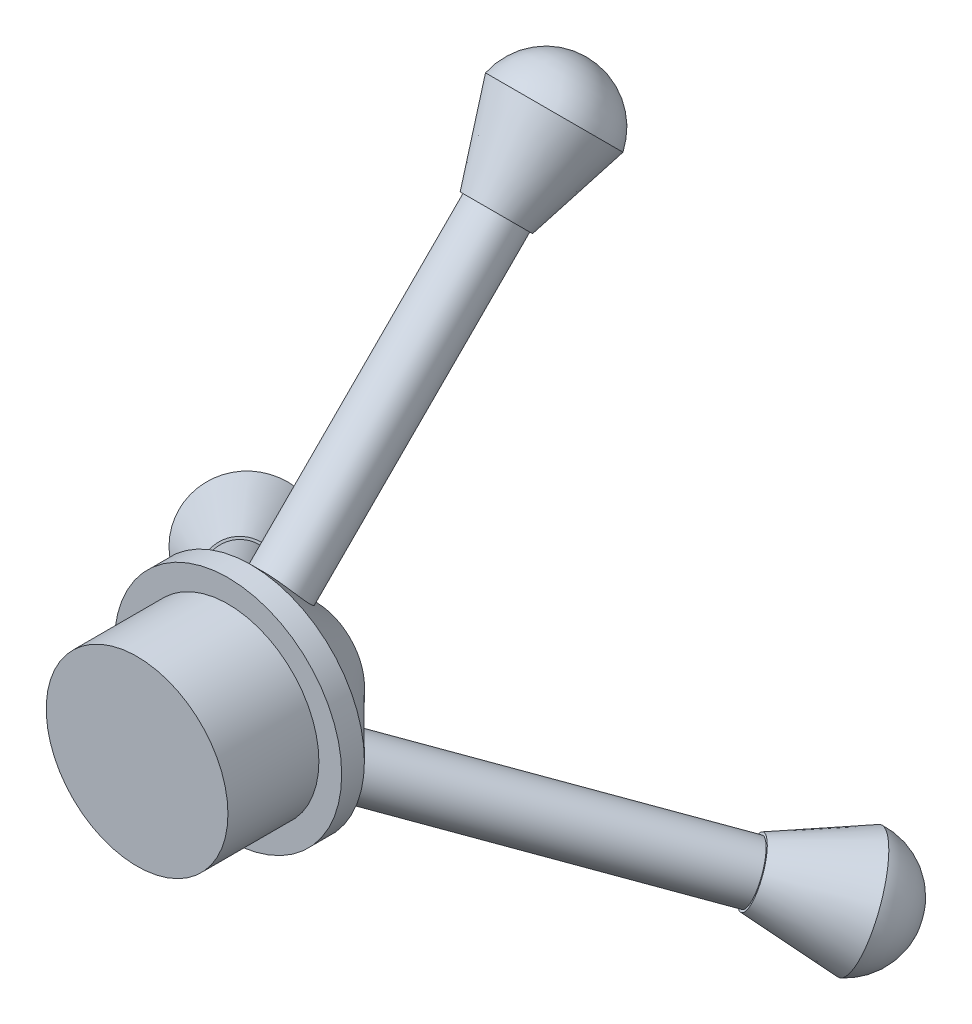
ISO-10303-21;
HEADER;
FILE_DESCRIPTION(('STEP AP214'),'2;1');
FILE_NAME('part.step','',(''),(''),'','','');
FILE_SCHEMA(('AUTOMOTIVE_DESIGN { 1 0 10303 214 1 1 1 1 }'));
ENDSEC;
DATA;
#1=APPLICATION_CONTEXT('core data for automotive mechanical design processes');
#2=APPLICATION_PROTOCOL_DEFINITION('international standard','automotive_design',2000,#1);
#3=PRODUCT_CONTEXT('',#1,'mechanical');
#4=PRODUCT('Part','Part','',(#3));
#5=PRODUCT_RELATED_PRODUCT_CATEGORY('part','',(#4));
#6=PRODUCT_DEFINITION_FORMATION('','',#4);
#7=PRODUCT_DEFINITION_CONTEXT('part definition',#1,'design');
#8=PRODUCT_DEFINITION('design','',#6,#7);
#9=PRODUCT_DEFINITION_SHAPE('','',#8);
#10=(LENGTH_UNIT() NAMED_UNIT(*) SI_UNIT(.MILLI.,.METRE.));
#11=(NAMED_UNIT(*) PLANE_ANGLE_UNIT() SI_UNIT($,.RADIAN.));
#12=(NAMED_UNIT(*) SI_UNIT($,.STERADIAN.) SOLID_ANGLE_UNIT());
#13=UNCERTAINTY_MEASURE_WITH_UNIT(LENGTH_MEASURE(1.E-05),#10,'distance_accuracy_value','');
#14=(GEOMETRIC_REPRESENTATION_CONTEXT(3) GLOBAL_UNCERTAINTY_ASSIGNED_CONTEXT((#13)) GLOBAL_UNIT_ASSIGNED_CONTEXT((#10,
#11,#12)) REPRESENTATION_CONTEXT('',''));
#15=CARTESIAN_POINT('',(0.,0.,0.));
#16=DIRECTION('',(0.,0.,1.));
#17=DIRECTION('',(1.,0.,0.));
#18=AXIS2_PLACEMENT_3D('',#15,#16,#17);
#19=CARTESIAN_POINT('',(0.,0.,20.));
#20=DIRECTION('',(0.,0.,1.));
#21=DIRECTION('',(1.,0.,0.));
#22=AXIS2_PLACEMENT_3D('',#19,#20,#21);
#23=CONICAL_SURFACE('',#22,25.,0.785398163397451);
#24=CARTESIAN_POINT('',(-10.9923285042417,-8.84226013293502,9.10733320665737));
#25=CARTESIAN_POINT('',(-11.042067666894,-8.69632022086392,9.05461272138038));
#26=CARTESIAN_POINT('',(-11.0959779072019,-8.5499775990663,9.00713308822177));
#27=CARTESIAN_POINT('',(-11.2115666896517,-8.25719647000872,8.923274107096));
#28=CARTESIAN_POINT('',(-11.2732426990432,-8.11075800942672,8.88689115320621));
#29=CARTESIAN_POINT('',(-11.403773007322,-7.81861217091363,8.82577518647563));
#30=CARTESIAN_POINT('',(-11.4726290599692,-7.67290498075085,8.8010450280647));
#31=CARTESIAN_POINT('',(-11.6168887808461,-7.38319204496107,8.76364056362473));
#32=CARTESIAN_POINT('',(-11.6922923353385,-7.23918626982796,8.75096604822173));
#33=CARTESIAN_POINT('',(-11.8490778468359,-6.95378965622903,8.73788033869601));
#34=CARTESIAN_POINT('',(-11.930463202042,-6.81240036214522,8.73747617006182));
#35=CARTESIAN_POINT('',(-12.0985801552729,-6.53334788850022,8.74895541058032));
#36=CARTESIAN_POINT('',(-12.1853117836209,-6.39568473007953,8.76083888943286));
#37=CARTESIAN_POINT('',(-12.3635500550898,-6.12513644507364,8.79669330174738));
#38=CARTESIAN_POINT('',(-12.4550560384702,-5.99225066259431,8.82066256908912));
#39=CARTESIAN_POINT('',(-12.6423797548508,-5.73219849195895,8.88031198722794));
#40=CARTESIAN_POINT('',(-12.7381991019757,-5.60503428109717,8.9159965540329));
#41=CARTESIAN_POINT('',(-12.933113083538,-5.35814442562773,8.9982929056253));
#42=CARTESIAN_POINT('',(-13.0321863504582,-5.23838108386113,9.04484232419296));
#43=CARTESIAN_POINT('',(-13.2337542669769,-5.0063836888108,9.14832780188348));
#44=CARTESIAN_POINT('',(-13.3362501430236,-4.89415237884872,9.20526761762284));
#45=CARTESIAN_POINT('',(-13.5442596997168,-4.67813130083381,9.32875460579492));
#46=CARTESIAN_POINT('',(-13.6497728980658,-4.57434019375656,9.39530024961165));
#47=CARTESIAN_POINT('',(-13.8635479336782,-4.37593398113424,9.53721141095034));
#48=CARTESIAN_POINT('',(-13.9718107982734,-4.28132237081603,9.6125802641223));
#49=CARTESIAN_POINT('',(-14.1950338456752,-4.0985367190131,9.77437524353499));
#50=CARTESIAN_POINT('',(-14.3100901184568,-4.01076106144288,9.86111924034591));
#51=CARTESIAN_POINT('',(-14.5424704478156,-3.84670488647274,10.0422254278622));
#52=CARTESIAN_POINT('',(-14.659795339825,-3.77042869841636,10.1365904673226));
#53=CARTESIAN_POINT('',(-14.8962366034766,-3.63013726739487,10.331875211531));
#54=CARTESIAN_POINT('',(-15.0153524220095,-3.56611831951722,10.4327929232576));
#55=CARTESIAN_POINT('',(-15.2549966714236,-3.45092697572059,10.6402333038166));
#56=CARTESIAN_POINT('',(-15.3755256020289,-3.3997592772234,10.7467580049714));
#57=CARTESIAN_POINT('',(-15.6192013830514,-3.31019935829013,10.9659625442163));
#58=CARTESIAN_POINT('',(-15.7423606940295,-3.27200565011797,11.0787097709776));
#59=CARTESIAN_POINT('',(-15.9889051388381,-3.20991422085914,11.3078386181502));
#60=CARTESIAN_POINT('',(-16.1122902715624,-3.18601642993166,11.4242202208033));
#61=CARTESIAN_POINT('',(-16.3585408459498,-3.15286142537154,11.6595559531251));
#62=CARTESIAN_POINT('',(-16.4814063649632,-3.14360195024106,11.7785096825426));
#63=CARTESIAN_POINT('',(-16.7258290898503,-3.13991405286262,12.0179851047926));
#64=CARTESIAN_POINT('',(-16.8473863012816,-3.14548556758702,12.1385067909594));
#65=CARTESIAN_POINT('',(-17.085035650679,-3.17114367137156,12.3768385526928));
#66=CARTESIAN_POINT('',(-17.2011864922124,-3.19083115372325,12.4946331719698));
#67=CARTESIAN_POINT('',(-17.4306110956443,-3.2441693467009,12.7299411420514));
#68=CARTESIAN_POINT('',(-17.543883861725,-3.27782482229074,12.8474543830961));
#69=CARTESIAN_POINT('',(-17.7665991775395,-3.35883124287049,13.0813003433725));
#70=CARTESIAN_POINT('',(-17.8760433030177,-3.40617647745882,13.1976335339377));
#71=CARTESIAN_POINT('',(-18.0902852996309,-3.51415632228949,13.4284200239348));
#72=CARTESIAN_POINT('',(-18.1950814318254,-3.57479585669917,13.5428726098666));
#73=CARTESIAN_POINT('',(-18.4983066968703,-3.77405810009583,13.8791564662749));
#74=CARTESIAN_POINT('',(-18.6889000503262,-3.93124809346988,14.0973969147668));
#75=CARTESIAN_POINT('',(-19.0422075871984,-4.29016899312786,14.5190268241367));
#76=CARTESIAN_POINT('',(-19.2049194779911,-4.49190355908336,14.722415062966));
#77=CARTESIAN_POINT('',(-19.4995423896409,-4.93731949398624,15.1140708393512));
#78=CARTESIAN_POINT('',(-19.6308883463937,-5.18165026546732,15.3020259241862));
#79=CARTESIAN_POINT('',(-19.8542697770541,-5.70226722688367,15.6557251369385));
#80=CARTESIAN_POINT('',(-19.9463006991928,-5.97855711223981,15.8214666915207));
#81=CARTESIAN_POINT('',(-20.0885479714528,-6.5605167440149,16.1310953282501));
#82=CARTESIAN_POINT('',(-20.1379200442147,-6.86665183266261,16.2744970285473));
#83=CARTESIAN_POINT('',(-20.1888957599977,-7.49442517134434,16.5331261896391));
#84=CARTESIAN_POINT('',(-20.1904989860178,-7.81606355669076,16.6483534044742));
#85=CARTESIAN_POINT('',(-20.1444829257277,-8.46503282800753,16.8485989627517));
#86=CARTESIAN_POINT('',(-20.0968869676775,-8.79236094381551,16.9336315975672));
#87=CARTESIAN_POINT('',(-19.9526981376613,-9.44290282270434,17.0719829500498));
#88=CARTESIAN_POINT('',(-19.8561100953528,-9.76611698812102,17.1253047926529));
#89=CARTESIAN_POINT('',(-19.6178504245002,-10.3936846344992,17.1986293055175));
#90=CARTESIAN_POINT('',(-19.4768951854917,-10.6982517673505,17.2191319149126));
#91=CARTESIAN_POINT('',(-19.1532699738221,-11.2848428757192,17.227983968107));
#92=CARTESIAN_POINT('',(-18.9706029303059,-11.5668684323061,17.216335669016));
#93=CARTESIAN_POINT('',(-18.5710598414927,-12.0976042220967,17.1614031105105));
#94=CARTESIAN_POINT('',(-18.3545482210485,-12.3466223747147,17.1184397980566));
#95=CARTESIAN_POINT('',(-17.8926569370965,-12.8080623246444,17.0020548057881));
#96=CARTESIAN_POINT('',(-17.6472763840172,-13.0204829937384,16.9286321872197));
#97=CARTESIAN_POINT('',(-17.1335286521767,-13.4048209472797,16.7520395384032));
#98=CARTESIAN_POINT('',(-16.865015885181,-13.5764516041398,16.6486697052543));
#99=CARTESIAN_POINT('',(-16.3148807391477,-13.8734952302959,16.4141346759726));
#100=CARTESIAN_POINT('',(-16.0332570412199,-13.9989035385041,16.2829666787567));
#101=CARTESIAN_POINT('',(-15.4611642726424,-14.2026479747328,15.9926298565311));
#102=CARTESIAN_POINT('',(-15.1706257678813,-14.2802000622417,15.8330471653444));
#103=CARTESIAN_POINT('',(-14.5945183079585,-14.3838084677238,15.4899390143724));
#104=CARTESIAN_POINT('',(-14.3089496718524,-14.4098614915584,15.3064120237899));
#105=CARTESIAN_POINT('',(-13.7507028174724,-14.4105037270148,14.9174309927286));
#106=CARTESIAN_POINT('',(-13.4781044768945,-14.3848079961651,14.7118614807795));
#107=CARTESIAN_POINT('',(-12.9569602597329,-14.2827254469739,14.2835244158851));
#108=CARTESIAN_POINT('',(-12.7084116991013,-14.2063442928143,14.0607587870927));
#109=CARTESIAN_POINT('',(-12.2478916348564,-14.0072509830122,13.6065219088219));
#110=CARTESIAN_POINT('',(-12.0354006951557,-13.8852959848352,13.3752457798153));
#111=CARTESIAN_POINT('',(-11.6495548363,-13.5989513732638,12.9064434230058));
#112=CARTESIAN_POINT('',(-11.4761929096357,-13.4345693693282,12.6689183228353));
#113=CARTESIAN_POINT('',(-11.1770671879748,-13.0722332542247,12.199129797115));
#114=CARTESIAN_POINT('',(-11.0504105749272,-12.8750264298477,11.9668572276358));
#115=CARTESIAN_POINT('',(-10.8427006661789,-12.4503182759328,11.5097227094133));
#116=CARTESIAN_POINT('',(-10.7616533024312,-12.2228130105267,11.2848617282021));
#117=CARTESIAN_POINT('',(-10.6453575162153,-11.7415796518252,10.8484889805232));
#118=CARTESIAN_POINT('',(-10.6104304725628,-11.4876807111541,10.6370805580835));
#119=CARTESIAN_POINT('',(-10.585951219376,-10.9605686692753,10.2370266659641));
#120=CARTESIAN_POINT('',(-10.5963909526423,-10.6873590061558,10.0483771603869));
#121=CARTESIAN_POINT('',(-10.6564078685523,-10.1550743595055,9.71885272538752));
#122=CARTESIAN_POINT('',(-10.7019668687723,-9.89731804410119,9.5750868236224));
#123=CARTESIAN_POINT('',(-10.8244863948037,-9.37424230809545,9.3174940314354));
#124=CARTESIAN_POINT('',(-10.9014444431966,-9.10892348571983,9.20366478014465));
#125=CARTESIAN_POINT('',(-10.9923285042417,-8.84226013293502,9.10733320665737));
#126=B_SPLINE_CURVE_WITH_KNOTS('',3,(#24,#25,#26,#27,#28,#29,#30,#31,#32,#33,#34,#35,#36,#37,
#38,#39,#40,#41,#42,#43,#44,#45,#46,#47,#48,#49,#50,#51,#52,#53,#54,#55,#56,#57,#58,#59,#60,#61,
#62,#63,#64,#65,#66,#67,#68,#69,#70,#71,#72,#73,#74,#75,#76,#77,#78,#79,#80,#81,#82,#83,#84,#85,
#86,#87,#88,#89,#90,#91,#92,#93,#94,#95,#96,#97,#98,#99,#100,#101,#102,#103,#104,#105,#106,#107,
#108,#109,#110,#111,#112,#113,#114,#115,#116,#117,#118,#119,#120,#121,#122,#123,#124,#125),
.UNSPECIFIED.,.T.,.F.,(4,2,2,2,2,2,2,2,2,2,2,2,2,2,2,2,2,2,2,2,2,2,2,2,2,2,2,2,2,2,2,2,2,2,2,2,
2,2,2,2,2,2,2,2,2,2,2,2,2,2,4),(0.,0.488594802048114,0.977030663140137,1.46558610773031,
1.95413306727707,2.4429597431538,2.93178919184233,3.42055126999484,3.90949779585485,
4.39570385863647,4.88208605728581,5.36839094103602,5.85488027167414,6.36046270280709,
6.86623500384586,7.37185418634918,7.87765791598783,8.39088477136607,8.90410911942198,
9.41725417084041,9.93039704153712,10.4295763779237,10.9289261417362,11.4280679118072,
11.9273948757374,12.9113288800097,13.8953437519561,14.8959357998516,15.89664366172,
16.9167308108601,17.9368268649081,18.9564394525039,19.9759515458487,20.9797802204438,
21.9835384244393,22.9771512531434,23.9707947072043,24.9712265838229,25.9717593169718,
26.988276699656,28.0048591017926,29.0270543820577,30.0491354495053,31.0549405974667,
32.0605654753217,33.0458253314307,34.031213301139,35.0234321065941,36.0154746998794,
36.9083120675921,37.8010790030957),.UNSPECIFIED.);
#127=CARTESIAN_POINT('',(-10.9923285042417,-8.84226013293502,9.10733320665737));
#128=VERTEX_POINT('',#127);
#129=EDGE_CURVE('E108',#128,#128,#126,.T.);
#130=ORIENTED_EDGE('',*,*,#129,.T.);
#131=EDGE_LOOP('',(#130));
#132=FACE_BOUND('',#131,.T.);
#133=CARTESIAN_POINT('',(-2.16145764987119,13.9407657978846,9.10733320665737));
#134=CARTESIAN_POINT('',(-2.01020039726538,13.910871220269,9.05461272138038));
#135=CARTESIAN_POINT('',(-1.85650884897829,13.8843875470009,9.00713308822176));
#136=CARTESIAN_POINT('',(-1.54515856224084,13.8380998044661,8.923274107096));
#137=CARTESIAN_POINT('',(-1.38750113058998,13.8182935651122,8.88689115320621));
#138=CARTESIAN_POINT('',(-1.06923025868833,13.785263208789,8.82577518647563));
#139=CARTESIAN_POINT('',(-0.908616104169707,13.7720407045044,8.8010450280647));
#140=CARTESIAN_POINT('',(-0.585587481532351,13.7521168196317,8.76364056362473));
#141=CARTESIAN_POINT('',(-0.423173044729216,13.7454153257912,8.75096604822173));
#142=CARTESIAN_POINT('',(-0.0976195714498031,13.7384972548938,8.73788033869602));
#143=CARTESIAN_POINT('',(0.0655198266530136,13.7382843929565,8.73747617006183));
#144=CARTESIAN_POINT('',(0.391244834433906,13.7443517084387,8.74895541058033));
#145=CARTESIAN_POINT('',(0.553830440965433,13.7506319226894,8.76083888943287));
#146=CARTESIAN_POINT('',(0.877251264465302,13.7697166512051,8.79669330174738));
#147=CARTESIAN_POINT('',(1.03808671958434,13.7825202661711,8.82066256908911));
#148=CARTESIAN_POINT('',(1.35696036385415,13.8147212779703,8.88031198722793));
#149=CARTESIAN_POINT('',(1.51499747447512,13.8341211613237,8.9159965540329));
#150=CARTESIAN_POINT('',(1.82626735202948,13.8794766931747,8.9982929056253));
#151=CARTESIAN_POINT('',(1.97952208190157,13.9053949882802,9.04484232419297));
#152=CARTESIAN_POINT('',(2.28122167788632,13.9639592270481,9.14832780188349));
#153=CARTESIAN_POINT('',(2.42966478143682,13.9966076045066,9.20526761762284));
#154=CARTESIAN_POINT('',(2.72074930109722,14.0687386258254,9.32875460579491));
#155=CARTESIAN_POINT('',(2.86339163568756,14.1082201824916,9.39530024961165));
#156=CARTESIAN_POINT('',(3.14210397389335,14.1941516877157,9.53721141095034));
#157=CARTESIAN_POINT('',(3.27817146421945,14.2406042735825,9.6125802641223));
#158=CARTESIAN_POINT('',(3.54808000582902,14.3425282774412,9.77437524353499));
#159=CARTESIAN_POINT('',(3.68162409150948,14.3982821037497,9.86111924034591));
#160=CARTESIAN_POINT('',(3.93989107136073,14.5175012848291,10.0422254278622));
#161=CARTESIAN_POINT('',(4.0646106339261,14.5809695277773,10.1365904673226));
#162=CARTESIAN_POINT('',(4.3043272089498,14.7155879530918,10.331875211531));
#163=CARTESIAN_POINT('',(4.41932715340184,14.786735803995,10.4327929232576));
#164=CARTESIAN_POINT('',(4.63890790813282,14.9366781399602,10.6402333038166));
#165=CARTESIAN_POINT('',(4.74348490018724,15.0154754065067,10.7467580049714));
#166=CARTESIAN_POINT('',(4.94288395565559,15.1817248636926,10.9659625442163));
#167=CARTESIAN_POINT('',(5.03754033268646,15.2692871016262,11.0787097709776));
#168=CARTESIAN_POINT('',(5.21458531018617,15.4517551393629,11.3078386181502));
#169=CARTESIAN_POINT('',(5.29697397058585,15.5466609032877,11.4242202208033));
#170=CARTESIAN_POINT('',(5.44881233399122,15.7433426541237,11.6595559531251));
#171=CARTESIAN_POINT('',(5.51826403418663,15.8451175772732,11.7785096825426));
#172=CARTESIAN_POINT('',(5.64366920944642,16.0549499175984,12.0179851047926));
#173=CARTESIAN_POINT('',(5.69962274187319,16.1630073080733,12.1385067909594));
#174=CARTESIAN_POINT('',(5.79622684688156,16.3816467337366,12.3768385526928));
#175=CARTESIAN_POINT('',(5.83725240779513,16.4920800543513,12.4946331719698));
#176=CARTESIAN_POINT('',(5.90577247940047,16.7174366856653,12.7299411420514));
#177=CARTESIAN_POINT('',(5.93326236560356,16.832361516443,12.8474543830961));
#178=CARTESIAN_POINT('',(5.97446640541911,17.0657418480401,13.0813003433724));
#179=CARTESIAN_POINT('',(5.9881862922566,17.1841958582934,13.1976335339377));
#180=CARTESIAN_POINT('',(6.00179400184315,17.4237247923333,13.4284200239348));
#181=CARTESIAN_POINT('',(6.00167669066795,17.5448006722369,13.5428726098666));
#182=CARTESIAN_POINT('',(5.98072315839379,17.9070325765333,13.8791564662749));
#183=CARTESIAN_POINT('',(5.9398893076391,18.1506862591056,14.0973969147668));
#184=CARTESIAN_POINT('',(5.80570845902226,18.6361200112145,14.5190268241367));
#185=CARTESIAN_POINT('',(5.71235714547973,18.8778999251165,14.722415062966));
#186=CARTESIAN_POINT('',(5.47392708642834,19.3557588185937,15.1140708393512));
#187=CARTESIAN_POINT('',(5.32800340977585,19.5916731395665,15.3020259241862));
#188=CARTESIAN_POINT('',(4.98882661087845,20.0454356139603,15.6557251369385));
#189=CARTESIAN_POINT('',(4.79556801242067,20.2632816731441,15.8214666915207));
#190=CARTESIAN_POINT('',(4.36269982345642,20.6774512404279,16.1310953282501));
#191=CARTESIAN_POINT('',(4.12226509607866,20.8732762540011,16.2744970285473));
#192=CARTESIAN_POINT('',(3.6040852948532,21.2313091881861,16.5331261896391));
#193=CARTESIAN_POINT('',(3.32633989532107,21.3935168153208,16.6483534044742));
#194=CARTESIAN_POINT('',(2.74130798994019,21.6781503737858,16.8485989627517));
#195=CARTESIAN_POINT('',(2.43403554725248,21.8005951229008,16.9336315975672));
#196=CARTESIAN_POINT('',(1.79855533890099,22.0009948726093,17.0719829500498));
#197=CARTESIAN_POINT('',(1.47034963963292,22.0789542569767,17.1253047926529));
#198=CARTESIAN_POINT('',(0.807730279849927,22.1863991525101,17.1986293055175));
#199=CARTESIAN_POINT('',(0.473489786138626,22.2166119011579,17.2191319149126));
#200=CARTESIAN_POINT('',(-0.196325621177463,22.2296398007312,17.227983968107));
#201=CARTESIAN_POINT('',(-0.531900439456309,22.2124582789055,17.216335669016));
#202=CARTESIAN_POINT('',(-1.19130266051918,22.131811708982,17.1614031105105));
#203=CARTESIAN_POINT('',(-1.51521451691193,22.0688162217718,17.1184397980566));
#204=CARTESIAN_POINT('',(-2.14577887784801,21.8995266110476,17.0020548057881));
#205=CARTESIAN_POINT('',(-2.45243085011202,21.7932311530333,16.9286321872197));
#206=CARTESIAN_POINT('',(-3.04215114743751,21.5404815428934,16.7520395384032));
#207=CARTESIAN_POINT('',(-3.32504403984447,21.3937579938648,16.6486697052543));
#208=CARTESIAN_POINT('',(-3.8573589391445,21.0658487949633,16.4141346759726));
#209=CARTESIAN_POINT('',(-4.10677756886238,20.8846596723542,16.2829666787567));
#210=CARTESIAN_POINT('',(-4.56927181080489,20.4910850195591,15.9926298565311));
#211=CARTESIAN_POINT('',(-4.78170314108467,20.2782473374129,15.8330471653444));
#212=CARTESIAN_POINT('',(-5.15948438223924,19.831127844551,15.4899390143724));
#213=CARTESIAN_POINT('',(-5.32483128077836,19.5968446630764,15.3064120237899));
#214=CARTESIAN_POINT('',(-5.60451090018888,19.1137098233287,14.9174309927286));
#215=CARTESIAN_POINT('',(-5.71855691479312,18.864784869934,14.7118614807795));
#216=CARTESIAN_POINT('',(-5.89072294249136,18.3624194642411,14.2835244158851));
#217=CARTESIAN_POINT('',(-5.94884920293451,18.1089795195802,14.0607587870927));
#218=CARTESIAN_POINT('',(-6.00668937104481,17.6106107900907,13.6065219088219));
#219=CARTESIAN_POINT('',(-6.0073187143554,17.3656107391473,13.3752457798153));
#220=CARTESIAN_POINT('',(-5.9522599359256,16.8882861176476,12.9064434230058));
#221=CARTESIAN_POINT('',(-5.89658190792463,16.6559592831395,12.6689183228353));
#222=CARTESIAN_POINT('',(-5.73235248836686,16.215740751704,12.199129797115));
#223=CARTESIAN_POINT('',(-5.62489467518055,16.007449495059,11.9668572276358));
#224=CARTESIAN_POINT('',(-5.36094157906995,15.6152133605078,11.5097227094133));
#225=CARTESIAN_POINT('',(-5.20443992160739,15.4312716518895,11.2848617282021));
#226=CARTESIAN_POINT('',(-4.8458275009313,15.0899398673227,10.8484889805232));
#227=CARTESIAN_POINT('',(-4.64340809014247,14.9327426899049,10.6370805580835));
#228=CARTESIAN_POINT('',(-4.19915529782816,14.6479870138402,10.2370266659641));
#229=CARTESIAN_POINT('',(-3.95732892237415,14.5204232564977,10.0483771603869));
#230=CARTESIAN_POINT('',(-3.46634843837558,14.3062571070074,9.71885272538751));
#231=CARTESIAN_POINT('',(-3.22034542113955,14.2168342008668,9.5750868236224));
#232=CARTESIAN_POINT('',(-2.70608878263959,14.0614013548668,9.31749403143539));
#233=CARTESIAN_POINT('',(-2.43783691816372,13.9953895686129,9.20366478014465));
#234=CARTESIAN_POINT('',(-2.16145764987119,13.9407657978846,9.10733320665737));
#235=B_SPLINE_CURVE_WITH_KNOTS('',3,(#133,#134,#135,#136,#137,#138,#139,#140,#141,#142,#143,
#144,#145,#146,#147,#148,#149,#150,#151,#152,#153,#154,#155,#156,#157,#158,#159,#160,#161,#162,
#163,#164,#165,#166,#167,#168,#169,#170,#171,#172,#173,#174,#175,#176,#177,#178,#179,#180,#181,
#182,#183,#184,#185,#186,#187,#188,#189,#190,#191,#192,#193,#194,#195,#196,#197,#198,#199,#200,
#201,#202,#203,#204,#205,#206,#207,#208,#209,#210,#211,#212,#213,#214,#215,#216,#217,#218,#219,
#220,#221,#222,#223,#224,#225,#226,#227,#228,#229,#230,#231,#232,#233,#234),.UNSPECIFIED.,.T.,
.F.,(4,2,2,2,2,2,2,2,2,2,2,2,2,2,2,2,2,2,2,2,2,2,2,2,2,2,2,2,2,2,2,2,2,2,2,2,2,2,2,2,2,2,2,2,2,
2,2,2,2,2,4),(0.,0.488594802048115,0.977030663140136,1.46558610773031,1.95413306727707,
2.4429597431538,2.93178919184233,3.42055126999484,3.90949779585485,4.39570385863646,
4.8820860572858,5.36839094103602,5.85488027167413,6.36046270280709,6.86623500384585,
7.37185418634917,7.87765791598783,8.39088477136607,8.90410911942197,9.4172541708404,
9.93039704153712,10.4295763779237,10.9289261417362,11.4280679118072,11.9273948757374,
12.9113288800097,13.8953437519561,14.8959357998516,15.89664366172,16.9167308108601,
17.9368268649081,18.9564394525039,19.9759515458487,20.9797802204438,21.9835384244393,
22.9771512531434,23.9707947072042,24.9712265838229,25.9717593169718,26.988276699656,
28.0048591017926,29.0270543820577,30.0491354495053,31.0549405974667,32.0605654753217,
33.0458253314307,34.031213301139,35.0234321065941,36.0154746998794,36.9083120675921,
37.8010790030957),.UNSPECIFIED.);
#236=CARTESIAN_POINT('',(-2.16145764987119,13.9407657978846,9.10733320665737));
#237=VERTEX_POINT('',#236);
#238=EDGE_CURVE('E62',#237,#237,#235,.T.);
#239=ORIENTED_EDGE('',*,*,#238,.T.);
#240=EDGE_LOOP('',(#239));
#241=FACE_BOUND('',#240,.T.);
#242=CARTESIAN_POINT('',(0.,0.,20.));
#243=DIRECTION('',(0.,0.,1.));
#244=DIRECTION('',(1.,0.,0.));
#245=AXIS2_PLACEMENT_3D('',#242,#243,#244);
#246=CIRCLE('',#245,25.);
#247=CARTESIAN_POINT('',(-25.,0.,20.));
#248=VERTEX_POINT('',#247);
#249=EDGE_CURVE('E10',#248,#248,#246,.T.);
#250=ORIENTED_EDGE('',*,*,#249,.F.);
#251=EDGE_LOOP('',(#250));
#252=FACE_BOUND('',#251,.T.);
#253=CARTESIAN_POINT('',(0.,0.,5.6542829754862));
#254=DIRECTION('',(0.,0.,-1.));
#255=DIRECTION('',(-1.,0.,0.));
#256=AXIS2_PLACEMENT_3D('',#253,#254,#255);
#257=CIRCLE('',#256,10.6542829754861);
#258=CARTESIAN_POINT('',(-10.6542829754861,0.,5.6542829754862));
#259=VERTEX_POINT('',#258);
#260=EDGE_CURVE('E71',#259,#259,#257,.F.);
#261=ORIENTED_EDGE('',*,*,#260,.T.);
#262=EDGE_LOOP('',(#261));
#263=FACE_BOUND('',#262,.T.);
#264=CARTESIAN_POINT('',(13.153786154113,-5.09850566494952,9.10733320665737));
#265=CARTESIAN_POINT('',(13.0522680641595,-5.21455099940497,9.05461272138038));
#266=CARTESIAN_POINT('',(12.9524867561803,-5.33440994793451,9.00713308822177));
#267=CARTESIAN_POINT('',(12.7567252518926,-5.58090333445733,8.92327410709601));
#268=CARTESIAN_POINT('',(12.6607438296333,-5.70753555568545,8.88689115320622));
#269=CARTESIAN_POINT('',(12.4730032660104,-5.96665103787527,8.82577518647564));
#270=CARTESIAN_POINT('',(12.381245164139,-6.09913572375346,8.80104502806471));
#271=CARTESIAN_POINT('',(12.2024762623785,-6.36892477467057,8.76364056362473));
#272=CARTESIAN_POINT('',(12.1154653800678,-6.50622905596318,8.75096604822173));
#273=CARTESIAN_POINT('',(11.9466974182858,-6.78470759866471,8.73788033869601));
#274=CARTESIAN_POINT('',(11.8649433753891,-6.92588403081118,8.73747617006183));
#275=CARTESIAN_POINT('',(11.7073353208391,-7.21100381993846,8.74895541058033));
#276=CARTESIAN_POINT('',(11.6314813426556,-7.35494719260977,8.76083888943287));
#277=CARTESIAN_POINT('',(11.4862987906246,-7.64458020613142,8.79669330174738));
#278=CARTESIAN_POINT('',(11.4169693188859,-7.79026960357673,8.82066256908912));
#279=CARTESIAN_POINT('',(11.2854193909967,-8.08252278601132,8.88031198722794));
#280=CARTESIAN_POINT('',(11.2232016275007,-8.22908688022644,8.9159965540329));
#281=CARTESIAN_POINT('',(11.1068457315086,-8.52133226754691,8.9982929056253));
#282=CARTESIAN_POINT('',(11.0526642685568,-8.66701390441902,9.04484232419296));
#283=CARTESIAN_POINT('',(10.9525325890907,-8.95757553823727,9.14832780188349));
#284=CARTESIAN_POINT('',(10.9065853615869,-9.10245522565785,9.20526761762284));
#285=CARTESIAN_POINT('',(10.8235103986197,-9.39060732499155,9.32875460579492));
#286=CARTESIAN_POINT('',(10.7863812623784,-9.533879988735,9.39530024961165));
#287=CARTESIAN_POINT('',(10.721443959785,-9.81821770658143,9.53721141095034));
#288=CARTESIAN_POINT('',(10.693639334054,-9.95928190276642,9.6125802641223));
#289=CARTESIAN_POINT('',(10.6469538398463,-10.2439915584281,9.77437524353499));
#290=CARTESIAN_POINT('',(10.6284660269474,-10.3875210423067,9.86111924034591));
#291=CARTESIAN_POINT('',(10.602579376455,-10.6707963983563,10.0422254278622));
#292=CARTESIAN_POINT('',(10.595184705899,-10.8105408293609,10.1365904673226));
#293=CARTESIAN_POINT('',(10.591909394527,-11.0854506856969,10.331875211531));
#294=CARTESIAN_POINT('',(10.5960252686078,-11.2206174844778,10.4327929232576));
#295=CARTESIAN_POINT('',(10.6160887632909,-11.4857511642395,10.6402333038166));
#296=CARTESIAN_POINT('',(10.6320407018418,-11.6157161292833,10.7467580049714));
#297=CARTESIAN_POINT('',(10.676317427396,-11.8715255054025,10.9659625442163));
#298=CARTESIAN_POINT('',(10.7048203613432,-11.9972814515082,11.0787097709776));
#299=CARTESIAN_POINT('',(10.7743198286521,-12.2418409185037,11.3078386181502));
#300=CARTESIAN_POINT('',(10.8153163009767,-12.360644473356,11.4242202208033));
#301=CARTESIAN_POINT('',(10.9097285119587,-12.5904812287521,11.6595559531251));
#302=CARTESIAN_POINT('',(10.9631423307768,-12.7015156270321,11.7785096825426));
#303=CARTESIAN_POINT('',(11.082159880404,-12.9150358647357,12.0179851047926));
#304=CARTESIAN_POINT('',(11.1477635594085,-13.0175217404862,12.1385067909594));
#305=CARTESIAN_POINT('',(11.2888088037976,-13.210503062365,12.3768385526928));
#306=CARTESIAN_POINT('',(11.3639340844174,-13.301248900628,12.4946331719698));
#307=CARTESIAN_POINT('',(11.524838616244,-13.4732673389644,12.7299411420514));
#308=CARTESIAN_POINT('',(11.6106214961215,-13.5545366941522,12.8474543830961));
#309=CARTESIAN_POINT('',(11.7921327721205,-13.7069106051696,13.0813003433724));
#310=CARTESIAN_POINT('',(11.8878570107613,-13.7780193808346,13.1976335339377));
#311=CARTESIAN_POINT('',(12.0884912977879,-13.9095684700438,13.4284200239348));
#312=CARTESIAN_POINT('',(12.1934047411576,-13.9700048155377,13.5428726098666));
#313=CARTESIAN_POINT('',(12.5175835384766,-14.1329744764375,13.8791564662749));
#314=CARTESIAN_POINT('',(12.7490107426872,-14.2194381656357,14.0973969147668));
#315=CARTESIAN_POINT('',(13.2364991281763,-14.3459510180866,14.5190268241367));
#316=CARTESIAN_POINT('',(13.4925623325116,-14.3859963660332,14.722415062966));
#317=CARTESIAN_POINT('',(14.0256153032127,-14.4184393246074,15.1140708393512));
#318=CARTESIAN_POINT('',(14.302884936618,-14.4100228740991,15.3020259241862));
#319=CARTESIAN_POINT('',(14.8654431661758,-14.3431683870766,15.6557251369385));
#320=CARTESIAN_POINT('',(15.1507326867723,-14.2847245609043,15.8214666915207));
#321=CARTESIAN_POINT('',(15.7258481479965,-14.1169344964129,16.1310953282501));
#322=CARTESIAN_POINT('',(16.0156549481362,-14.0066244213384,16.2744970285473));
#323=CARTESIAN_POINT('',(16.5848104651447,-13.7368840168417,16.5331261896391));
#324=CARTESIAN_POINT('',(16.8641590906969,-13.5774532586299,16.6483534044742));
#325=CARTESIAN_POINT('',(17.4031749357877,-13.2131175457782,16.8485989627517));
#326=CARTESIAN_POINT('',(17.6628514204251,-13.0082341790853,16.9336315975672));
#327=CARTESIAN_POINT('',(18.1541427987604,-12.5580920499049,17.0719829500498));
#328=CARTESIAN_POINT('',(18.38576045572,-12.3128372688556,17.1253047926529));
#329=CARTESIAN_POINT('',(18.8101201446504,-11.7927145180108,17.1986293055175));
#330=CARTESIAN_POINT('',(19.0034053993532,-11.5183601338073,17.2191319149126));
#331=CARTESIAN_POINT('',(19.3495955949997,-10.944796925012,17.227983968107));
#332=CARTESIAN_POINT('',(19.5025033697624,-10.6455898465993,17.216335669016));
#333=CARTESIAN_POINT('',(19.762362502012,-10.0342074868852,17.1614031105105));
#334=CARTESIAN_POINT('',(19.8697627379606,-9.72219384705702,17.1184397980566));
#335=CARTESIAN_POINT('',(20.0384358149447,-9.09146428640319,17.0020548057881));
#336=CARTESIAN_POINT('',(20.0997072341293,-8.77274815929477,16.9286321872197));
#337=CARTESIAN_POINT('',(20.1756797996144,-8.13566059561366,16.7520395384032));
#338=CARTESIAN_POINT('',(20.1900599250256,-7.81730638972487,16.6486697052543));
#339=CARTESIAN_POINT('',(20.1722396782924,-7.19235356466735,16.4141346759726));
#340=CARTESIAN_POINT('',(20.1400346100824,-6.88575613385001,16.2829666787567));
#341=CARTESIAN_POINT('',(20.0304360834475,-6.28843704482622,15.9926298565311));
#342=CARTESIAN_POINT('',(19.9523289089661,-5.9980472751711,15.8330471653444));
#343=CARTESIAN_POINT('',(19.7540026901978,-5.44731937682709,15.4899390143724));
#344=CARTESIAN_POINT('',(19.6337809526309,-5.18698317151792,15.3064120237898));
#345=CARTESIAN_POINT('',(19.3552137176614,-4.70320609631383,14.9174309927286));
#346=CARTESIAN_POINT('',(19.1966613916878,-4.47997687376882,14.7118614807795));
#347=CARTESIAN_POINT('',(18.8476832022243,-4.07969401726704,14.2835244158851));
#348=CARTESIAN_POINT('',(18.6572609020359,-3.90263522676585,14.0607587870927));
#349=CARTESIAN_POINT('',(18.2545810059013,-3.6033598070784,13.6065219088219));
#350=CARTESIAN_POINT('',(18.0427194095112,-3.48031475431205,13.3752457798153));
#351=CARTESIAN_POINT('',(17.6018147722257,-3.28933474438374,12.9064434230058));
#352=CARTESIAN_POINT('',(17.3727748175604,-3.22138991381114,12.6689183228353));
#353=CARTESIAN_POINT('',(16.9094196763417,-3.14350749747922,12.199129797115));
#354=CARTESIAN_POINT('',(16.6753052501078,-3.13242306521118,11.9668572276358));
#355=CARTESIAN_POINT('',(16.2036422452489,-3.16489508457492,11.5097227094133));
#356=CARTESIAN_POINT('',(15.9660932240387,-3.2084586413627,11.2848617282021));
#357=CARTESIAN_POINT('',(15.4911850171467,-3.34836021549743,10.8484889805232));
#358=CARTESIAN_POINT('',(15.2538385627053,-3.44506197875077,10.6370805580835));
#359=CARTESIAN_POINT('',(14.7851065172043,-3.68741834456476,10.2370266659641));
#360=CARTESIAN_POINT('',(14.5537198750165,-3.83306425034182,10.0483771603869));
#361=CARTESIAN_POINT('',(14.1227563069279,-4.1511827475018,9.71885272538752));
#362=CARTESIAN_POINT('',(13.9223122899119,-4.31951615676552,9.57508682362241));
#363=CARTESIAN_POINT('',(13.5305751774434,-4.68715904677129,9.3174940314354));
#364=CARTESIAN_POINT('',(13.3392813613604,-4.88646608289296,9.20366478014465));
#365=CARTESIAN_POINT('',(13.153786154113,-5.09850566494952,9.10733320665737));
#366=B_SPLINE_CURVE_WITH_KNOTS('',3,(#264,#265,#266,#267,#268,#269,#270,#271,#272,#273,#274,
#275,#276,#277,#278,#279,#280,#281,#282,#283,#284,#285,#286,#287,#288,#289,#290,#291,#292,#293,
#294,#295,#296,#297,#298,#299,#300,#301,#302,#303,#304,#305,#306,#307,#308,#309,#310,#311,#312,
#313,#314,#315,#316,#317,#318,#319,#320,#321,#322,#323,#324,#325,#326,#327,#328,#329,#330,#331,
#332,#333,#334,#335,#336,#337,#338,#339,#340,#341,#342,#343,#344,#345,#346,#347,#348,#349,#350,
#351,#352,#353,#354,#355,#356,#357,#358,#359,#360,#361,#362,#363,#364,#365),.UNSPECIFIED.,.T.,
.F.,(4,2,2,2,2,2,2,2,2,2,2,2,2,2,2,2,2,2,2,2,2,2,2,2,2,2,2,2,2,2,2,2,2,2,2,2,2,2,2,2,2,2,2,2,2,
2,2,2,2,2,4),(0.,0.488594802048114,0.977030663140136,1.46558610773031,1.95413306727706,
2.4429597431538,2.93178919184233,3.42055126999484,3.90949779585485,4.39570385863646,
4.8820860572858,5.36839094103602,5.85488027167413,6.36046270280708,6.86623500384585,
7.37185418634917,7.87765791598783,8.39088477136607,8.90410911942197,9.4172541708404,
9.93039704153711,10.4295763779237,10.9289261417362,11.4280679118072,11.9273948757374,
12.9113288800097,13.8953437519561,14.8959357998516,15.89664366172,16.9167308108601,
17.9368268649081,18.9564394525039,19.9759515458487,20.9797802204438,21.9835384244393,
22.9771512531434,23.9707947072043,24.9712265838229,25.9717593169718,26.9882766996561,
28.0048591017926,29.0270543820577,30.0491354495053,31.0549405974667,32.0605654753217,
33.0458253314307,34.031213301139,35.0234321065942,36.0154746998794,36.9083120675921,
37.8010790030957),.UNSPECIFIED.);
#367=CARTESIAN_POINT('',(13.153786154113,-5.09850566494952,9.10733320665737));
#368=VERTEX_POINT('',#367);
#369=EDGE_CURVE('E117',#368,#368,#366,.T.);
#370=ORIENTED_EDGE('',*,*,#369,.T.);
#371=EDGE_LOOP('',(#370));
#372=FACE_BOUND('',#371,.T.);
#373=ADVANCED_FACE('F43',(#132,#241,#252,#263,#372),#23,.T.);
#374=CARTESIAN_POINT('',(0.,0.,45.));
#375=DIRECTION('',(0.,0.,-1.));
#376=DIRECTION('',(-1.,0.,0.));
#377=AXIS2_PLACEMENT_3D('',#374,#375,#376);
#378=CYLINDRICAL_SURFACE('',#377,25.);
#379=CARTESIAN_POINT('',(0.,0.,25.));
#380=DIRECTION('',(0.,0.,1.));
#381=DIRECTION('',(1.,0.,0.));
#382=AXIS2_PLACEMENT_3D('',#379,#380,#381);
#383=CIRCLE('',#382,25.);
#384=CARTESIAN_POINT('',(-25.,0.,25.));
#385=VERTEX_POINT('',#384);
#386=EDGE_CURVE('E52',#385,#385,#383,.T.);
#387=CARTESIAN_POINT('',(-25.,0.,20.));
#388=CARTESIAN_POINT('',(-25.,0.,20.0520833333333));
#389=CARTESIAN_POINT('',(-25.,0.,20.1041666666667));
#390=CARTESIAN_POINT('',(-25.,0.,20.2083333333333));
#391=CARTESIAN_POINT('',(-25.,0.,20.2604166666667));
#392=CARTESIAN_POINT('',(-25.,0.,20.3645833333333));
#393=CARTESIAN_POINT('',(-25.,0.,20.4166666666667));
#394=CARTESIAN_POINT('',(-25.,0.,20.5208333333333));
#395=CARTESIAN_POINT('',(-25.,0.,20.5729166666667));
#396=CARTESIAN_POINT('',(-25.,0.,20.6770833333333));
#397=CARTESIAN_POINT('',(-25.,0.,20.7291666666667));
#398=CARTESIAN_POINT('',(-25.,0.,20.8333333333333));
#399=CARTESIAN_POINT('',(-25.,0.,20.8854166666667));
#400=CARTESIAN_POINT('',(-25.,0.,20.9895833333333));
#401=CARTESIAN_POINT('',(-25.,0.,21.0416666666667));
#402=CARTESIAN_POINT('',(-25.,0.,21.1458333333333));
#403=CARTESIAN_POINT('',(-25.,0.,21.1979166666667));
#404=CARTESIAN_POINT('',(-25.,0.,21.3020833333333));
#405=CARTESIAN_POINT('',(-25.,0.,21.3541666666667));
#406=CARTESIAN_POINT('',(-25.,0.,21.4583333333333));
#407=CARTESIAN_POINT('',(-25.,0.,21.5104166666667));
#408=CARTESIAN_POINT('',(-25.,0.,21.6145833333333));
#409=CARTESIAN_POINT('',(-25.,0.,21.6666666666667));
#410=CARTESIAN_POINT('',(-25.,0.,21.7708333333333));
#411=CARTESIAN_POINT('',(-25.,0.,21.8229166666667));
#412=CARTESIAN_POINT('',(-25.,0.,21.9270833333333));
#413=CARTESIAN_POINT('',(-25.,0.,21.9791666666667));
#414=CARTESIAN_POINT('',(-25.,0.,22.0833333333333));
#415=CARTESIAN_POINT('',(-25.,0.,22.1354166666667));
#416=CARTESIAN_POINT('',(-25.,0.,22.2395833333333));
#417=CARTESIAN_POINT('',(-25.,0.,22.2916666666667));
#418=CARTESIAN_POINT('',(-25.,0.,22.3958333333333));
#419=CARTESIAN_POINT('',(-25.,0.,22.4479166666667));
#420=CARTESIAN_POINT('',(-25.,0.,22.5520833333333));
#421=CARTESIAN_POINT('',(-25.,0.,22.6041666666667));
#422=CARTESIAN_POINT('',(-25.,0.,22.7083333333333));
#423=CARTESIAN_POINT('',(-25.,0.,22.7604166666667));
#424=CARTESIAN_POINT('',(-25.,0.,22.8645833333333));
#425=CARTESIAN_POINT('',(-25.,0.,22.9166666666667));
#426=CARTESIAN_POINT('',(-25.,0.,23.0208333333333));
#427=CARTESIAN_POINT('',(-25.,0.,23.0729166666667));
#428=CARTESIAN_POINT('',(-25.,0.,23.1770833333333));
#429=CARTESIAN_POINT('',(-25.,0.,23.2291666666667));
#430=CARTESIAN_POINT('',(-25.,0.,23.3333333333333));
#431=CARTESIAN_POINT('',(-25.,0.,23.3854166666667));
#432=CARTESIAN_POINT('',(-25.,0.,23.4895833333333));
#433=CARTESIAN_POINT('',(-25.,0.,23.5416666666667));
#434=CARTESIAN_POINT('',(-25.,0.,23.6458333333333));
#435=CARTESIAN_POINT('',(-25.,0.,23.6979166666667));
#436=CARTESIAN_POINT('',(-25.,0.,23.8020833333333));
#437=CARTESIAN_POINT('',(-25.,0.,23.8541666666667));
#438=CARTESIAN_POINT('',(-25.,0.,23.9583333333333));
#439=CARTESIAN_POINT('',(-25.,0.,24.0104166666667));
#440=CARTESIAN_POINT('',(-25.,0.,24.1145833333333));
#441=CARTESIAN_POINT('',(-25.,0.,24.1666666666667));
#442=CARTESIAN_POINT('',(-25.,0.,24.2708333333333));
#443=CARTESIAN_POINT('',(-25.,0.,24.3229166666667));
#444=CARTESIAN_POINT('',(-25.,0.,24.4270833333333));
#445=CARTESIAN_POINT('',(-25.,0.,24.4791666666667));
#446=CARTESIAN_POINT('',(-25.,0.,24.5833333333333));
#447=CARTESIAN_POINT('',(-25.,0.,24.6354166666667));
#448=CARTESIAN_POINT('',(-25.,0.,24.7395833333333));
#449=CARTESIAN_POINT('',(-25.,0.,24.7916666666667));
#450=CARTESIAN_POINT('',(-25.,0.,24.8958333333333));
#451=CARTESIAN_POINT('',(-25.,0.,24.9479166666667));
#452=CARTESIAN_POINT('',(-25.,0.,25.));
#453=B_SPLINE_CURVE_WITH_KNOTS('',3,(#387,#388,#389,#390,#391,#392,#393,#394,#395,#396,#397,
#398,#399,#400,#401,#402,#403,#404,#405,#406,#407,#408,#409,#410,#411,#412,#413,#414,#415,#416,
#417,#418,#419,#420,#421,#422,#423,#424,#425,#426,#427,#428,#429,#430,#431,#432,#433,#434,#435,
#436,#437,#438,#439,#440,#441,#442,#443,#444,#445,#446,#447,#448,#449,#450,#451,#452),
.UNSPECIFIED.,.F.,.F.,(4,2,2,2,2,2,2,2,2,2,2,2,2,2,2,2,2,2,2,2,2,2,2,2,2,2,2,2,2,2,2,2,4),(0.,
0.15625,0.3125,0.468749999999997,0.624999999999997,0.781249999999997,0.937499999999997,1.09375,
1.24999999999999,1.40624999999999,1.56249999999999,1.71874999999999,1.87499999999999,
2.03124999999999,2.18749999999999,2.34374999999999,2.49999999999999,2.65624999999999,
2.81249999999999,2.96874999999999,3.12499999999999,3.28124999999999,3.43749999999999,
3.59374999999999,3.74999999999999,3.90624999999999,4.06249999999999,4.21874999999999,
4.37499999999999,4.53124999999999,4.68749999999998,4.84374999999998,4.99999999999998),.UNSPECIFIED.);
#454=EDGE_CURVE('BSEAM91',#248,#385,#453,.T.);
#455=ORIENTED_EDGE('',*,*,#249,.T.);
#456=ORIENTED_EDGE('',*,*,#386,.F.);
#457=ORIENTED_EDGE('',*,*,#454,.T.);
#458=ORIENTED_EDGE('',*,*,#454,.F.);
#459=EDGE_LOOP('',(#455,#457,#456,#458));
#460=FACE_BOUND('',#459,.T.);
#461=ADVANCED_FACE('F91',(#460),#378,.T.);
#462=CARTESIAN_POINT('',(0.,0.,25.));
#463=DIRECTION('',(0.,0.,1.));
#464=DIRECTION('',(1.,0.,0.));
#465=AXIS2_PLACEMENT_3D('',#462,#463,#464);
#466=PLANE('',#465);
#467=CARTESIAN_POINT('',(0.,0.,25.));
#468=DIRECTION('',(0.,0.,1.));
#469=DIRECTION('',(1.,0.,0.));
#470=AXIS2_PLACEMENT_3D('',#467,#468,#469);
#471=CIRCLE('',#470,19.985);
#472=CARTESIAN_POINT('',(19.985,0.,25.));
#473=VERTEX_POINT('',#472);
#474=EDGE_CURVE('E58',#473,#473,#471,.T.);
#475=ORIENTED_EDGE('',*,*,#474,.F.);
#476=EDGE_LOOP('',(#475));
#477=FACE_BOUND('',#476,.T.);
#478=ORIENTED_EDGE('',*,*,#386,.T.);
#479=EDGE_LOOP('',(#478));
#480=FACE_BOUND('',#479,.T.);
#481=ADVANCED_FACE('F87',(#477,#480),#466,.T.);
#482=CARTESIAN_POINT('',(0.,0.,25.));
#483=DIRECTION('',(0.,0.,1.));
#484=DIRECTION('',(1.,0.,0.));
#485=AXIS2_PLACEMENT_3D('',#482,#483,#484);
#486=CYLINDRICAL_SURFACE('',#485,19.985);
#487=ORIENTED_EDGE('',*,*,#474,.T.);
#488=EDGE_LOOP('',(#487));
#489=FACE_BOUND('',#488,.T.);
#490=CARTESIAN_POINT('',(0.,0.,45.));
#491=DIRECTION('',(0.,0.,1.));
#492=DIRECTION('',(1.,0.,0.));
#493=AXIS2_PLACEMENT_3D('',#490,#491,#492);
#494=CIRCLE('',#493,19.985);
#495=CARTESIAN_POINT('',(19.985,0.,45.));
#496=VERTEX_POINT('',#495);
#497=EDGE_CURVE('E69',#496,#496,#494,.T.);
#498=ORIENTED_EDGE('',*,*,#497,.F.);
#499=EDGE_LOOP('',(#498));
#500=FACE_BOUND('',#499,.T.);
#501=ADVANCED_FACE('F84',(#489,#500),#486,.T.);
#502=CARTESIAN_POINT('',(0.,0.,45.));
#503=DIRECTION('',(0.,0.,1.));
#504=DIRECTION('',(1.,0.,0.));
#505=AXIS2_PLACEMENT_3D('',#502,#503,#504);
#506=PLANE('',#505);
#507=ORIENTED_EDGE('',*,*,#497,.T.);
#508=EDGE_LOOP('',(#507));
#509=FACE_BOUND('',#508,.T.);
#510=ADVANCED_FACE('F81',(#509),#506,.T.);
#511=CARTESIAN_POINT('',(0.,64.9793077082,-34.0156416579166));
#512=DIRECTION('',(0.,-0.707106781186547,0.707106781186548));
#513=DIRECTION('',(0.,-0.707106781186548,-0.707106781186547));
#514=AXIS2_PLACEMENT_3D('',#511,#512,#513);
#515=CYLINDRICAL_SURFACE('',#514,6.);
#516=ORIENTED_EDGE('',*,*,#238,.F.);
#517=EDGE_LOOP('',(#516));
#518=FACE_BOUND('',#517,.T.);
#519=CARTESIAN_POINT('',(0.,64.9793077082,-34.0156416579166));
#520=DIRECTION('',(0.,0.707106781186547,-0.707106781186548));
#521=DIRECTION('',(0.,0.707106781186548,0.707106781186547));
#522=AXIS2_PLACEMENT_3D('',#519,#520,#521);
#523=CIRCLE('',#522,6.);
#524=CARTESIAN_POINT('',(0.,69.2219483953193,-29.7730009707973));
#525=VERTEX_POINT('',#524);
#526=EDGE_CURVE('E70',#525,#525,#523,.T.);
#527=ORIENTED_EDGE('',*,*,#526,.F.);
#528=EDGE_LOOP('',(#527));
#529=FACE_BOUND('',#528,.T.);
#530=ADVANCED_FACE('F75',(#518,#529),#515,.T.);
#531=CARTESIAN_POINT('',(70.,-12.676827059853,5.6542829754862));
#532=DIRECTION('',(0.,0.,-1.));
#533=DIRECTION('',(-1.,0.,0.));
#534=AXIS2_PLACEMENT_3D('',#531,#532,#533);
#535=PLANE('',#534);
#536=ORIENTED_EDGE('',*,*,#260,.F.);
#537=EDGE_LOOP('',(#536));
#538=FACE_BOUND('',#537,.T.);
#539=ADVANCED_FACE('F80',(#538),#535,.T.);
#540=CARTESIAN_POINT('',(0.,64.9793077082001,-34.0156416579166));
#541=DIRECTION('',(0.,0.707106781186548,-0.707106781186548));
#542=DIRECTION('',(0.,0.707106781186548,0.707106781186548));
#543=AXIS2_PLACEMENT_3D('',#540,#541,#542);
#544=CONICAL_SURFACE('',#543,6.5,0.314159265358979);
#545=CARTESIAN_POINT('',(0.,77.7072297695579,-46.7435637192745));
#546=DIRECTION('',(0.,0.707106781186548,-0.707106781186548));
#547=DIRECTION('',(0.,0.707106781186548,0.707106781186548));
#548=AXIS2_PLACEMENT_3D('',#545,#546,#547);
#549=CIRCLE('',#548,12.3485545321923);
#550=CARTESIAN_POINT('',(0.,86.438976417123,-38.0118170717094));
#551=VERTEX_POINT('',#550);
#552=EDGE_CURVE('E47',#551,#551,#549,.T.);
#553=ORIENTED_EDGE('',*,*,#552,.F.);
#554=EDGE_LOOP('',(#553));
#555=FACE_BOUND('',#554,.T.);
#556=CARTESIAN_POINT('',(0.,64.9793077082001,-34.0156416579166));
#557=DIRECTION('',(0.,0.707106781186548,-0.707106781186548));
#558=DIRECTION('',(0.,0.707106781186548,0.707106781186548));
#559=AXIS2_PLACEMENT_3D('',#556,#557,#558);
#560=CIRCLE('',#559,6.5);
#561=CARTESIAN_POINT('',(0.,69.5755017859126,-29.4194475802041));
#562=VERTEX_POINT('',#561);
#563=EDGE_CURVE('E205',#562,#562,#560,.T.);
#564=ORIENTED_EDGE('',*,*,#563,.T.);
#565=EDGE_LOOP('',(#564));
#566=FACE_BOUND('',#565,.T.);
#567=ADVANCED_FACE('F226',(#555,#566),#544,.T.);
#568=CARTESIAN_POINT('',(0.,75.8515411935534,-44.88787514327));
#569=DIRECTION('',(0.,0.,1.));
#570=DIRECTION('',(1.,0.,0.));
#571=AXIS2_PLACEMENT_3D('',#568,#569,#570);
#572=SPHERICAL_SURFACE('',#571,12.6243399517264);
#573=CARTESIAN_POINT('',(0.,75.8515411935534,-44.88787514327));
#574=DIRECTION('',(0.,0.707106781186548,-0.707106781186548));
#575=DIRECTION('',(0.,0.707106781186548,0.707106781186548));
#576=AXIS2_PLACEMENT_3D('',#573,#574,#575);
#577=SPHERICAL_SURFACE('',#576,12.6243399517264);
#578=ORIENTED_EDGE('',*,*,#552,.T.);
#579=EDGE_LOOP('',(#578));
#580=FACE_BOUND('',#579,.T.);
#581=ADVANCED_FACE('F45',(#580),#577,.T.);
#582=CARTESIAN_POINT('',(0.,64.9793077082001,-34.0156416579166));
#583=DIRECTION('',(0.,0.707106781186548,-0.707106781186548));
#584=DIRECTION('',(0.,0.707106781186548,0.707106781186548));
#585=AXIS2_PLACEMENT_3D('',#582,#583,#584);
#586=PLANE('',#585);
#587=ORIENTED_EDGE('',*,*,#526,.T.);
#588=EDGE_LOOP('',(#587));
#589=FACE_BOUND('',#588,.T.);
#590=ORIENTED_EDGE('',*,*,#563,.F.);
#591=EDGE_LOOP('',(#590));
#592=FACE_BOUND('',#591,.T.);
#593=ADVANCED_FACE('F181',(#589,#592),#586,.F.);
#594=CARTESIAN_POINT('',(-56.2737311956271,-32.4896538541003,-34.0156416579166));
#595=DIRECTION('',(0.612372435695793,0.353553390593277,0.707106781186548));
#596=DIRECTION('',(0.612372435695793,0.353553390593277,-0.707106781186547));
#597=AXIS2_PLACEMENT_3D('',#594,#595,#596);
#598=CYLINDRICAL_SURFACE('',#597,6.);
#599=ORIENTED_EDGE('',*,*,#129,.F.);
#600=EDGE_LOOP('',(#599));
#601=FACE_BOUND('',#600,.T.);
#602=CARTESIAN_POINT('',(-56.2737311956271,-32.4896538541003,-34.0156416579166));
#603=DIRECTION('',(-0.612372435695793,-0.353553390593277,-0.707106781186548));
#604=DIRECTION('',(-0.612372435695793,-0.353553390593277,0.707106781186547));
#605=AXIS2_PLACEMENT_3D('',#602,#603,#604);
#606=CIRCLE('',#605,6.);
#607=CARTESIAN_POINT('',(-59.9479658098018,-34.6109741976599,-29.7730009707973));
#608=VERTEX_POINT('',#607);
#609=EDGE_CURVE('E171',#608,#608,#606,.T.);
#610=ORIENTED_EDGE('',*,*,#609,.F.);
#611=EDGE_LOOP('',(#610));
#612=FACE_BOUND('',#611,.T.);
#613=ADVANCED_FACE('F176',(#601,#612),#598,.T.);
#614=CARTESIAN_POINT('',(-65.6893615898189,-37.925770596777,-44.88787514327));
#615=DIRECTION('',(0.,0.,1.));
#616=DIRECTION('',(-0.500000000000004,0.866025403784436,0.));
#617=AXIS2_PLACEMENT_3D('',#614,#615,#616);
#618=SPHERICAL_SURFACE('',#617,12.6243399517264);
#619=CARTESIAN_POINT('',(-65.6893615898189,-37.925770596777,-44.88787514327));
#620=DIRECTION('',(-0.612372435695793,-0.353553390593277,-0.707106781186547));
#621=DIRECTION('',(-0.612372435695793,-0.353553390593277,0.707106781186547));
#622=AXIS2_PLACEMENT_3D('',#619,#620,#621);
#623=SPHERICAL_SURFACE('',#622,12.6243399517264);
#624=CARTESIAN_POINT('',(-67.2964350381514,-38.8536148847793,-46.7435637192745));
#625=DIRECTION('',(-0.612372435695793,-0.353553390593277,-0.707106781186548));
#626=DIRECTION('',(-0.612372435695793,-0.353553390593277,0.707106781186548));
#627=AXIS2_PLACEMENT_3D('',#624,#625,#626);
#628=CIRCLE('',#627,12.3485545321923);
#629=CARTESIAN_POINT('',(-74.8583494543523,-43.2194882085618,-38.0118170717094));
#630=VERTEX_POINT('',#629);
#631=EDGE_CURVE('E201',#630,#630,#628,.T.);
#632=ORIENTED_EDGE('',*,*,#631,.T.);
#633=EDGE_LOOP('',(#632));
#634=FACE_BOUND('',#633,.T.);
#635=ADVANCED_FACE('F180',(#634),#623,.T.);
#636=CARTESIAN_POINT('',(-56.2737311956271,-32.4896538541003,-34.0156416579166));
#637=DIRECTION('',(-0.612372435695793,-0.353553390593277,-0.707106781186548));
#638=DIRECTION('',(-0.612372435695793,-0.353553390593277,0.707106781186548));
#639=AXIS2_PLACEMENT_3D('',#636,#637,#638);
#640=CONICAL_SURFACE('',#639,6.5,0.314159265358979);
#641=ORIENTED_EDGE('',*,*,#631,.F.);
#642=EDGE_LOOP('',(#641));
#643=FACE_BOUND('',#642,.T.);
#644=CARTESIAN_POINT('',(-56.2737311956271,-32.4896538541003,-34.0156416579166));
#645=DIRECTION('',(-0.612372435695793,-0.353553390593277,-0.707106781186548));
#646=DIRECTION('',(-0.612372435695793,-0.353553390593277,0.707106781186548));
#647=AXIS2_PLACEMENT_3D('',#644,#645,#646);
#648=CIRCLE('',#647,6.5);
#649=CARTESIAN_POINT('',(-60.2541520276498,-34.7877508929566,-29.4194475802041));
#650=VERTEX_POINT('',#649);
#651=EDGE_CURVE('E198',#650,#650,#648,.T.);
#652=ORIENTED_EDGE('',*,*,#651,.T.);
#653=EDGE_LOOP('',(#652));
#654=FACE_BOUND('',#653,.T.);
#655=ADVANCED_FACE('F185',(#643,#654),#640,.T.);
#656=CARTESIAN_POINT('',(-56.2737311956271,-32.4896538541003,-34.0156416579166));
#657=DIRECTION('',(-0.612372435695793,-0.353553390593277,-0.707106781186548));
#658=DIRECTION('',(-0.612372435695793,-0.353553390593277,0.707106781186548));
#659=AXIS2_PLACEMENT_3D('',#656,#657,#658);
#660=PLANE('',#659);
#661=ORIENTED_EDGE('',*,*,#609,.T.);
#662=EDGE_LOOP('',(#661));
#663=FACE_BOUND('',#662,.T.);
#664=ORIENTED_EDGE('',*,*,#651,.F.);
#665=EDGE_LOOP('',(#664));
#666=FACE_BOUND('',#665,.T.);
#667=ADVANCED_FACE('F140',(#663,#666),#660,.F.);
#668=CARTESIAN_POINT('',(56.2737311956275,-32.4896538540995,-34.0156416579166));
#669=DIRECTION('',(-0.612372435695798,0.353553390593268,0.707106781186548));
#670=DIRECTION('',(-0.612372435695798,0.353553390593268,-0.707106781186547));
#671=AXIS2_PLACEMENT_3D('',#668,#669,#670);
#672=CYLINDRICAL_SURFACE('',#671,6.);
#673=ORIENTED_EDGE('',*,*,#369,.F.);
#674=EDGE_LOOP('',(#673));
#675=FACE_BOUND('',#674,.T.);
#676=CARTESIAN_POINT('',(56.2737311956275,-32.4896538540995,-34.0156416579166));
#677=DIRECTION('',(0.612372435695798,-0.353553390593268,-0.707106781186548));
#678=DIRECTION('',(0.612372435695798,-0.353553390593268,0.707106781186547));
#679=AXIS2_PLACEMENT_3D('',#676,#677,#678);
#680=CIRCLE('',#679,6.);
#681=CARTESIAN_POINT('',(59.9479658098023,-34.6109741976591,-29.7730009707973));
#682=VERTEX_POINT('',#681);
#683=EDGE_CURVE('E120',#682,#682,#680,.T.);
#684=ORIENTED_EDGE('',*,*,#683,.F.);
#685=EDGE_LOOP('',(#684));
#686=FACE_BOUND('',#685,.T.);
#687=ADVANCED_FACE('F135',(#675,#686),#672,.T.);
#688=CARTESIAN_POINT('',(65.6893615898194,-37.9257705967761,-44.88787514327));
#689=DIRECTION('',(0.,0.,1.));
#690=DIRECTION('',(-0.499999999999992,-0.866025403784443,0.));
#691=AXIS2_PLACEMENT_3D('',#688,#689,#690);
#692=SPHERICAL_SURFACE('',#691,12.6243399517264);
#693=CARTESIAN_POINT('',(65.6893615898194,-37.9257705967761,-44.88787514327));
#694=DIRECTION('',(0.612372435695798,-0.353553390593268,-0.707106781186548));
#695=DIRECTION('',(0.612372435695798,-0.353553390593268,0.707106781186548));
#696=AXIS2_PLACEMENT_3D('',#693,#694,#695);
#697=SPHERICAL_SURFACE('',#696,12.6243399517264);
#698=CARTESIAN_POINT('',(67.2964350381519,-38.8536148847783,-46.7435637192745));
#699=DIRECTION('',(0.612372435695798,-0.353553390593268,-0.707106781186548));
#700=DIRECTION('',(0.612372435695798,-0.353553390593268,0.707106781186548));
#701=AXIS2_PLACEMENT_3D('',#698,#699,#700);
#702=CIRCLE('',#701,12.3485545321923);
#703=CARTESIAN_POINT('',(74.8583494543529,-43.2194882085608,-38.0118170717094));
#704=VERTEX_POINT('',#703);
#705=EDGE_CURVE('E159',#704,#704,#702,.T.);
#706=ORIENTED_EDGE('',*,*,#705,.T.);
#707=EDGE_LOOP('',(#706));
#708=FACE_BOUND('',#707,.T.);
#709=ADVANCED_FACE('F139',(#708),#697,.T.);
#710=CARTESIAN_POINT('',(56.2737311956275,-32.4896538540995,-34.0156416579166));
#711=DIRECTION('',(0.612372435695798,-0.353553390593268,-0.707106781186548));
#712=DIRECTION('',(0.612372435695798,-0.353553390593268,0.707106781186548));
#713=AXIS2_PLACEMENT_3D('',#710,#711,#712);
#714=CONICAL_SURFACE('',#713,6.5,0.314159265358979);
#715=ORIENTED_EDGE('',*,*,#705,.F.);
#716=EDGE_LOOP('',(#715));
#717=FACE_BOUND('',#716,.T.);
#718=CARTESIAN_POINT('',(56.2737311956275,-32.4896538540995,-34.0156416579166));
#719=DIRECTION('',(0.612372435695798,-0.353553390593268,-0.707106781186548));
#720=DIRECTION('',(0.612372435695798,-0.353553390593268,0.707106781186548));
#721=AXIS2_PLACEMENT_3D('',#718,#719,#720);
#722=CIRCLE('',#721,6.5);
#723=CARTESIAN_POINT('',(60.2541520276502,-34.7877508929557,-29.4194475802041));
#724=VERTEX_POINT('',#723);
#725=EDGE_CURVE('E124',#724,#724,#722,.T.);
#726=ORIENTED_EDGE('',*,*,#725,.T.);
#727=EDGE_LOOP('',(#726));
#728=FACE_BOUND('',#727,.T.);
#729=ADVANCED_FACE('F143',(#717,#728),#714,.T.);
#730=CARTESIAN_POINT('',(56.2737311956275,-32.4896538540995,-34.0156416579166));
#731=DIRECTION('',(0.612372435695798,-0.353553390593268,-0.707106781186548));
#732=DIRECTION('',(0.612372435695798,-0.353553390593268,0.707106781186548));
#733=AXIS2_PLACEMENT_3D('',#730,#731,#732);
#734=PLANE('',#733);
#735=ORIENTED_EDGE('',*,*,#683,.T.);
#736=EDGE_LOOP('',(#735));
#737=FACE_BOUND('',#736,.T.);
#738=ORIENTED_EDGE('',*,*,#725,.F.);
#739=EDGE_LOOP('',(#738));
#740=FACE_BOUND('',#739,.T.);
#741=ADVANCED_FACE('F147',(#737,#740),#734,.F.);
#742=CLOSED_SHELL('',(#373,#461,#481,#501,#510,#530,#539,#567,#581,#593,#613,#635,#655,#667,
#687,#709,#729,#741));
#743=MANIFOLD_SOLID_BREP('B2',#742);
#744=ADVANCED_BREP_SHAPE_REPRESENTATION('',(#18,#743),#14);
#745=SHAPE_DEFINITION_REPRESENTATION(#9,#744);
ENDSEC;
END-ISO-10303-21;
